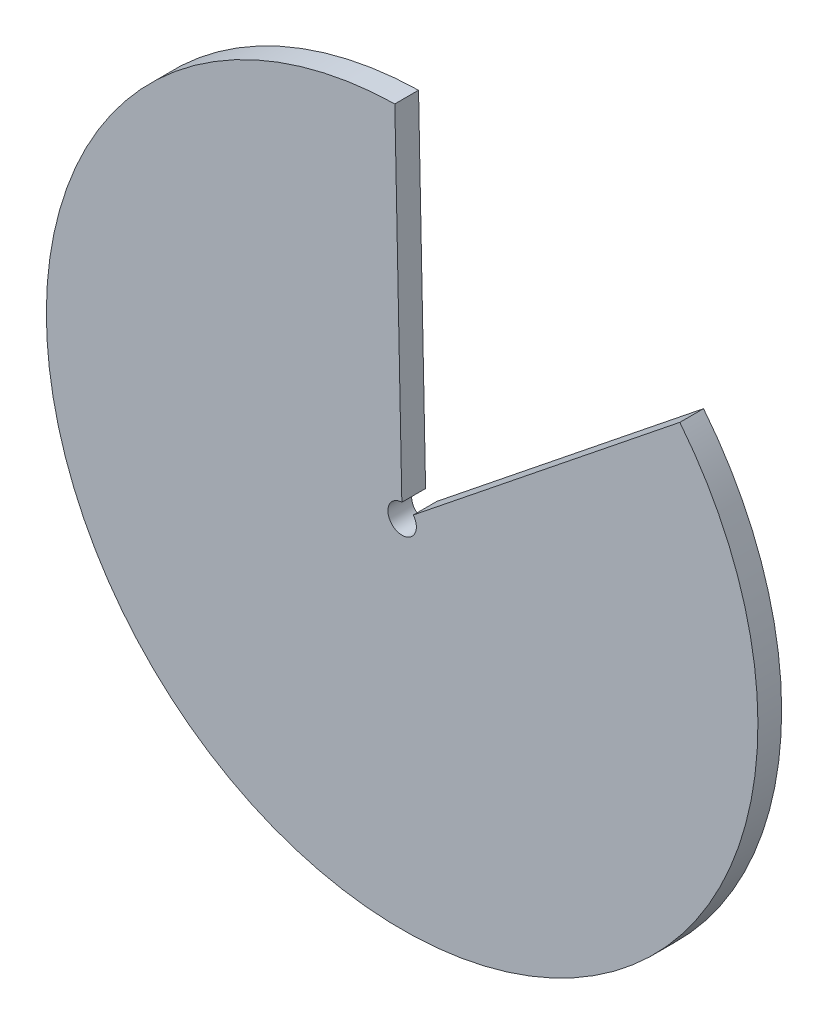
ISO-10303-21;
HEADER;
FILE_DESCRIPTION(('STEP AP214'),'2;1');
FILE_NAME('part.step','',(''),(''),'','','');
FILE_SCHEMA(('AUTOMOTIVE_DESIGN { 1 0 10303 214 1 1 1 1 }'));
ENDSEC;
DATA;
#1=APPLICATION_CONTEXT('core data for automotive mechanical design processes');
#2=APPLICATION_PROTOCOL_DEFINITION('international standard','automotive_design',2000,#1);
#3=PRODUCT_CONTEXT('',#1,'mechanical');
#4=PRODUCT('Part','Part','',(#3));
#5=PRODUCT_RELATED_PRODUCT_CATEGORY('part','',(#4));
#6=PRODUCT_DEFINITION_FORMATION('','',#4);
#7=PRODUCT_DEFINITION_CONTEXT('part definition',#1,'design');
#8=PRODUCT_DEFINITION('design','',#6,#7);
#9=PRODUCT_DEFINITION_SHAPE('','',#8);
#10=(LENGTH_UNIT() NAMED_UNIT(*) SI_UNIT(.MILLI.,.METRE.));
#11=(NAMED_UNIT(*) PLANE_ANGLE_UNIT() SI_UNIT($,.RADIAN.));
#12=(NAMED_UNIT(*) SI_UNIT($,.STERADIAN.) SOLID_ANGLE_UNIT());
#13=UNCERTAINTY_MEASURE_WITH_UNIT(LENGTH_MEASURE(1.E-05),#10,'distance_accuracy_value','');
#14=(GEOMETRIC_REPRESENTATION_CONTEXT(3) GLOBAL_UNCERTAINTY_ASSIGNED_CONTEXT((#13)) GLOBAL_UNIT_ASSIGNED_CONTEXT((#10,
#11,#12)) REPRESENTATION_CONTEXT('',''));
#15=CARTESIAN_POINT('',(0.,0.,0.));
#16=DIRECTION('',(0.,0.,1.));
#17=DIRECTION('',(1.,0.,0.));
#18=AXIS2_PLACEMENT_3D('',#15,#16,#17);
#19=CARTESIAN_POINT('',(0.,0.,2.54));
#20=DIRECTION('',(0.,0.,-1.));
#21=DIRECTION('',(-1.,0.,0.));
#22=AXIS2_PLACEMENT_3D('',#19,#20,#21);
#23=CYLINDRICAL_SURFACE('',#22,38.1);
#24=CARTESIAN_POINT('',(0.,0.,0.));
#25=DIRECTION('',(0.,0.,1.));
#26=DIRECTION('',(1.,0.,0.));
#27=AXIS2_PLACEMENT_3D('',#24,#25,#26);
#28=CIRCLE('',#27,38.1);
#29=CARTESIAN_POINT('',(-0.783784716554263,38.0919372245374,0.));
#30=VERTEX_POINT('',#29);
#31=CARTESIAN_POINT('',(29.7357052639744,23.8201140310882,0.));
#32=VERTEX_POINT('',#31);
#33=EDGE_CURVE('E81',#30,#32,#28,.T.);
#34=ORIENTED_EDGE('',*,*,#33,.T.);
#35=DIRECTION('',(0.,0.,1.));
#36=VECTOR('',#35,1.);
#37=CARTESIAN_POINT('',(29.7357052639744,23.8201140310882,0.));
#38=LINE('',#37,#36);
#39=CARTESIAN_POINT('',(29.7357052639744,23.8201140310882,2.54));
#40=VERTEX_POINT('',#39);
#41=EDGE_CURVE('E82',#32,#40,#38,.T.);
#42=ORIENTED_EDGE('',*,*,#41,.T.);
#43=CARTESIAN_POINT('',(0.,0.,2.54));
#44=DIRECTION('',(0.,0.,1.));
#45=DIRECTION('',(1.,0.,0.));
#46=AXIS2_PLACEMENT_3D('',#43,#44,#45);
#47=CIRCLE('',#46,38.1);
#48=CARTESIAN_POINT('',(-0.783784716554263,38.0919372245374,2.54));
#49=VERTEX_POINT('',#48);
#50=EDGE_CURVE('E46',#49,#40,#47,.T.);
#51=ORIENTED_EDGE('',*,*,#50,.F.);
#52=DIRECTION('',(0.,0.,1.));
#53=VECTOR('',#52,1.);
#54=CARTESIAN_POINT('',(-0.783784716554263,38.0919372245374,0.));
#55=LINE('',#54,#53);
#56=EDGE_CURVE('E71',#30,#49,#55,.T.);
#57=ORIENTED_EDGE('',*,*,#56,.F.);
#58=EDGE_LOOP('',(#34,#42,#51,#57));
#59=FACE_BOUND('',#58,.T.);
#60=ADVANCED_FACE('F38',(#59),#23,.T.);
#61=CARTESIAN_POINT('',(0.,0.,2.54));
#62=DIRECTION('',(0.,0.,1.));
#63=DIRECTION('',(1.,0.,0.));
#64=AXIS2_PLACEMENT_3D('',#61,#62,#63);
#65=PLANE('',#64);
#66=CARTESIAN_POINT('',(0.,0.,2.54));
#67=DIRECTION('',(0.,0.,1.));
#68=DIRECTION('',(1.,0.,0.));
#69=AXIS2_PLACEMENT_3D('',#66,#67,#68);
#70=CIRCLE('',#69,1.524);
#71=CARTESIAN_POINT('',(-0.0313513886621705,1.5236774889815,2.54));
#72=VERTEX_POINT('',#71);
#73=CARTESIAN_POINT('',(1.18942821055898,0.952804561243529,2.54));
#74=VERTEX_POINT('',#73);
#75=EDGE_CURVE('E90',#72,#74,#70,.T.);
#76=ORIENTED_EDGE('',*,*,#75,.F.);
#77=DIRECTION('',(0.0205717773373822,-0.999788378596781,0.));
#78=VECTOR('',#77,1.);
#79=CARTESIAN_POINT('',(0.,0.,2.54));
#80=LINE('',#79,#78);
#81=EDGE_CURVE('E75',#49,#72,#80,.T.);
#82=ORIENTED_EDGE('',*,*,#81,.F.);
#83=ORIENTED_EDGE('',*,*,#50,.T.);
#84=DIRECTION('',(0.780464705091191,0.625199843335649,0.));
#85=VECTOR('',#84,1.);
#86=CARTESIAN_POINT('',(0.,0.,2.54));
#87=LINE('',#86,#85);
#88=EDGE_CURVE('E93',#74,#40,#87,.T.);
#89=ORIENTED_EDGE('',*,*,#88,.F.);
#90=EDGE_LOOP('',(#76,#82,#83,#89));
#91=FACE_BOUND('',#90,.T.);
#92=ADVANCED_FACE('F87',(#91),#65,.T.);
#93=CARTESIAN_POINT('',(0.,0.,0.));
#94=DIRECTION('',(0.,0.,1.));
#95=DIRECTION('',(1.,0.,0.));
#96=AXIS2_PLACEMENT_3D('',#93,#94,#95);
#97=PLANE('',#96);
#98=DIRECTION('',(0.0205717773373822,-0.999788378596781,0.));
#99=VECTOR('',#98,1.);
#100=CARTESIAN_POINT('',(0.,0.,0.));
#101=LINE('',#100,#99);
#102=CARTESIAN_POINT('',(-0.0313513886621705,1.52367748898149,0.));
#103=VERTEX_POINT('',#102);
#104=EDGE_CURVE('E60',#30,#103,#101,.T.);
#105=ORIENTED_EDGE('',*,*,#104,.T.);
#106=CARTESIAN_POINT('',(0.,0.,0.));
#107=DIRECTION('',(0.,0.,1.));
#108=DIRECTION('',(1.,0.,0.));
#109=AXIS2_PLACEMENT_3D('',#106,#107,#108);
#110=CIRCLE('',#109,1.524);
#111=CARTESIAN_POINT('',(1.18942821055898,0.952804561243529,0.));
#112=VERTEX_POINT('',#111);
#113=EDGE_CURVE('E53',#103,#112,#110,.T.);
#114=ORIENTED_EDGE('',*,*,#113,.T.);
#115=DIRECTION('',(0.780464705091191,0.625199843335649,0.));
#116=VECTOR('',#115,1.);
#117=CARTESIAN_POINT('',(0.,0.,0.));
#118=LINE('',#117,#116);
#119=EDGE_CURVE('E92',#112,#32,#118,.T.);
#120=ORIENTED_EDGE('',*,*,#119,.T.);
#121=ORIENTED_EDGE('',*,*,#33,.F.);
#122=EDGE_LOOP('',(#105,#114,#120,#121));
#123=FACE_BOUND('',#122,.T.);
#124=ADVANCED_FACE('F118',(#123),#97,.F.);
#125=CARTESIAN_POINT('',(0.,0.,0.));
#126=DIRECTION('',(0.625199843335649,-0.780464705091191,0.));
#127=DIRECTION('',(0.780464705091191,0.625199843335649,0.));
#128=AXIS2_PLACEMENT_3D('',#125,#126,#127);
#129=PLANE('',#128);
#130=ORIENTED_EDGE('',*,*,#119,.F.);
#131=DIRECTION('',(0.,0.,1.));
#132=VECTOR('',#131,1.);
#133=CARTESIAN_POINT('',(1.18942821055898,0.952804561243529,0.));
#134=LINE('',#133,#132);
#135=EDGE_CURVE('E105',#112,#74,#134,.T.);
#136=ORIENTED_EDGE('',*,*,#135,.T.);
#137=ORIENTED_EDGE('',*,*,#88,.T.);
#138=ORIENTED_EDGE('',*,*,#41,.F.);
#139=EDGE_LOOP('',(#130,#136,#137,#138));
#140=FACE_BOUND('',#139,.T.);
#141=ADVANCED_FACE('F120',(#140),#129,.F.);
#142=CARTESIAN_POINT('',(0.,0.,0.));
#143=DIRECTION('',(-0.999788378596781,-0.0205717773373822,0.));
#144=DIRECTION('',(0.0205717773373822,-0.999788378596781,0.));
#145=AXIS2_PLACEMENT_3D('',#142,#143,#144);
#146=PLANE('',#145);
#147=ORIENTED_EDGE('',*,*,#81,.T.);
#148=DIRECTION('',(0.,0.,1.));
#149=VECTOR('',#148,1.);
#150=CARTESIAN_POINT('',(-0.0313513886621705,1.5236774889815,0.));
#151=LINE('',#150,#149);
#152=EDGE_CURVE('E11',#72,#103,#151,.F.);
#153=ORIENTED_EDGE('',*,*,#152,.T.);
#154=ORIENTED_EDGE('',*,*,#104,.F.);
#155=ORIENTED_EDGE('',*,*,#56,.T.);
#156=EDGE_LOOP('',(#147,#153,#154,#155));
#157=FACE_BOUND('',#156,.T.);
#158=ADVANCED_FACE('F73',(#157),#146,.F.);
#159=CARTESIAN_POINT('',(0.,0.,0.));
#160=DIRECTION('',(0.,0.,1.));
#161=DIRECTION('',(1.,0.,0.));
#162=AXIS2_PLACEMENT_3D('',#159,#160,#161);
#163=CYLINDRICAL_SURFACE('',#162,1.524);
#164=ORIENTED_EDGE('',*,*,#113,.F.);
#165=ORIENTED_EDGE('',*,*,#152,.F.);
#166=ORIENTED_EDGE('',*,*,#75,.T.);
#167=ORIENTED_EDGE('',*,*,#135,.F.);
#168=EDGE_LOOP('',(#164,#165,#166,#167));
#169=FACE_BOUND('',#168,.T.);
#170=ADVANCED_FACE('F124',(#169),#163,.F.);
#171=CLOSED_SHELL('',(#60,#92,#124,#141,#158,#170));
#172=MANIFOLD_SOLID_BREP('B2',#171);
#173=ADVANCED_BREP_SHAPE_REPRESENTATION('',(#18,#172),#14);
#174=SHAPE_DEFINITION_REPRESENTATION(#9,#173);
ENDSEC;
END-ISO-10303-21;
